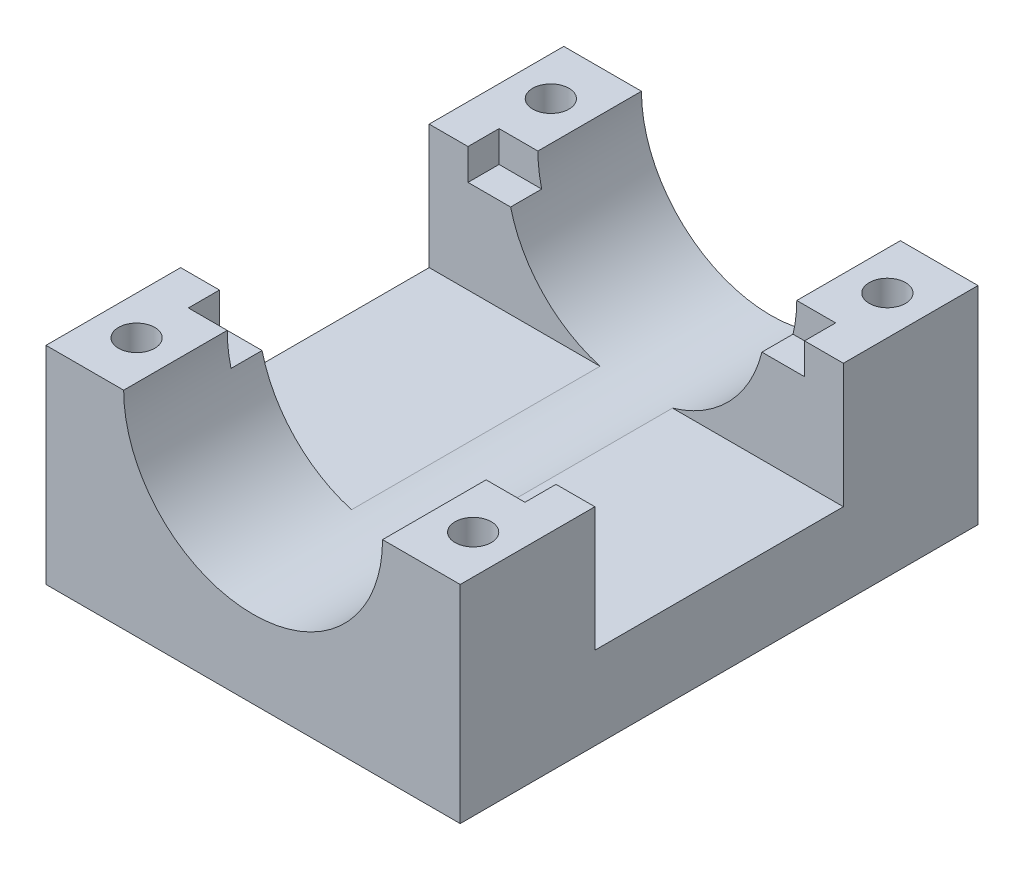
ISO-10303-21;
HEADER;
FILE_DESCRIPTION(('STEP AP214'),'2;1');
FILE_NAME('part.step','',(''),(''),'','','');
FILE_SCHEMA(('AUTOMOTIVE_DESIGN { 1 0 10303 214 1 1 1 1 }'));
ENDSEC;
DATA;
#1=APPLICATION_CONTEXT('core data for automotive mechanical design processes');
#2=APPLICATION_PROTOCOL_DEFINITION('international standard','automotive_design',2000,#1);
#3=PRODUCT_CONTEXT('',#1,'mechanical');
#4=PRODUCT('Part','Part','',(#3));
#5=PRODUCT_RELATED_PRODUCT_CATEGORY('part','',(#4));
#6=PRODUCT_DEFINITION_FORMATION('','',#4);
#7=PRODUCT_DEFINITION_CONTEXT('part definition',#1,'design');
#8=PRODUCT_DEFINITION('design','',#6,#7);
#9=PRODUCT_DEFINITION_SHAPE('','',#8);
#10=(LENGTH_UNIT() NAMED_UNIT(*) SI_UNIT(.MILLI.,.METRE.));
#11=(NAMED_UNIT(*) PLANE_ANGLE_UNIT() SI_UNIT($,.RADIAN.));
#12=(NAMED_UNIT(*) SI_UNIT($,.STERADIAN.) SOLID_ANGLE_UNIT());
#13=UNCERTAINTY_MEASURE_WITH_UNIT(LENGTH_MEASURE(1.E-05),#10,'distance_accuracy_value','');
#14=(GEOMETRIC_REPRESENTATION_CONTEXT(3) GLOBAL_UNCERTAINTY_ASSIGNED_CONTEXT((#13)) GLOBAL_UNIT_ASSIGNED_CONTEXT((#10,
#11,#12)) REPRESENTATION_CONTEXT('',''));
#15=CARTESIAN_POINT('',(0.,0.,0.));
#16=DIRECTION('',(0.,0.,1.));
#17=DIRECTION('',(1.,0.,0.));
#18=AXIS2_PLACEMENT_3D('',#15,#16,#17);
#19=CARTESIAN_POINT('',(0.,20.,0.));
#20=DIRECTION('',(0.,-1.,0.));
#21=DIRECTION('',(0.,0.,-1.));
#22=AXIS2_PLACEMENT_3D('',#19,#20,#21);
#23=PLANE('',#22);
#24=CARTESIAN_POINT('',(36.25,20.,-45.));
#25=DIRECTION('',(0.,1.,0.));
#26=DIRECTION('',(0.,0.,1.));
#27=AXIS2_PLACEMENT_3D('',#24,#25,#26);
#28=CIRCLE('',#27,1.75);
#29=CARTESIAN_POINT('',(36.25,20.,-43.25));
#30=VERTEX_POINT('',#29);
#31=EDGE_CURVE('E329',#30,#30,#28,.T.);
#32=ORIENTED_EDGE('',*,*,#31,.F.);
#33=EDGE_LOOP('',(#32));
#34=FACE_BOUND('',#33,.T.);
#35=DIRECTION('',(0.,0.,1.));
#36=VECTOR('',#35,1.);
#37=CARTESIAN_POINT('',(32.5,20.,-50.));
#38=LINE('',#37,#36);
#39=CARTESIAN_POINT('',(32.5,20.,-50.));
#40=VERTEX_POINT('',#39);
#41=CARTESIAN_POINT('',(32.5,20.,-40.));
#42=VERTEX_POINT('',#41);
#43=EDGE_CURVE('E396',#40,#42,#38,.T.);
#44=ORIENTED_EDGE('',*,*,#43,.T.);
#45=DIRECTION('',(-1.,0.,0.));
#46=VECTOR('',#45,1.);
#47=CARTESIAN_POINT('',(36.25,20.,-40.));
#48=LINE('',#47,#46);
#49=CARTESIAN_POINT('',(36.25,20.,-40.));
#50=VERTEX_POINT('',#49);
#51=EDGE_CURVE('E227',#50,#42,#48,.T.);
#52=ORIENTED_EDGE('',*,*,#51,.F.);
#53=DIRECTION('',(0.,0.,-1.));
#54=VECTOR('',#53,1.);
#55=CARTESIAN_POINT('',(36.25,20.,-37.));
#56=LINE('',#55,#54);
#57=CARTESIAN_POINT('',(36.25,20.,-37.));
#58=VERTEX_POINT('',#57);
#59=EDGE_CURVE('E254',#58,#50,#56,.T.);
#60=ORIENTED_EDGE('',*,*,#59,.F.);
#61=DIRECTION('',(1.,0.,0.));
#62=VECTOR('',#61,1.);
#63=CARTESIAN_POINT('',(0.,20.,-37.));
#64=LINE('',#63,#62);
#65=CARTESIAN_POINT('',(40.,20.,-37.));
#66=VERTEX_POINT('',#65);
#67=EDGE_CURVE('E232',#58,#66,#64,.T.);
#68=ORIENTED_EDGE('',*,*,#67,.T.);
#69=DIRECTION('',(0.,0.,-1.));
#70=VECTOR('',#69,1.);
#71=CARTESIAN_POINT('',(40.,20.,0.));
#72=LINE('',#71,#70);
#73=CARTESIAN_POINT('',(40.,20.,-50.));
#74=VERTEX_POINT('',#73);
#75=EDGE_CURVE('E363',#66,#74,#72,.T.);
#76=ORIENTED_EDGE('',*,*,#75,.T.);
#77=DIRECTION('',(-1.,0.,0.));
#78=VECTOR('',#77,1.);
#79=CARTESIAN_POINT('',(0.,20.,-50.));
#80=LINE('',#79,#78);
#81=EDGE_CURVE('E368',#74,#40,#80,.T.);
#82=ORIENTED_EDGE('',*,*,#81,.T.);
#83=EDGE_LOOP('',(#44,#52,#60,#68,#76,#82));
#84=FACE_BOUND('',#83,.T.);
#85=ADVANCED_FACE('F32',(#34,#84),#23,.F.);
#86=CARTESIAN_POINT('',(3.75,20.,-45.));
#87=DIRECTION('',(0.,1.,0.));
#88=DIRECTION('',(0.,0.,1.));
#89=AXIS2_PLACEMENT_3D('',#86,#87,#88);
#90=CIRCLE('',#89,1.75);
#91=CARTESIAN_POINT('',(3.75,20.,-43.25));
#92=VERTEX_POINT('',#91);
#93=EDGE_CURVE('E328',#92,#92,#90,.T.);
#94=ORIENTED_EDGE('',*,*,#93,.F.);
#95=EDGE_LOOP('',(#94));
#96=FACE_BOUND('',#95,.T.);
#97=CARTESIAN_POINT('',(0.,20.,-37.));
#98=VERTEX_POINT('',#97);
#99=CARTESIAN_POINT('',(3.75,20.,-37.));
#100=VERTEX_POINT('',#99);
#101=EDGE_CURVE('E310',#98,#100,#64,.T.);
#102=ORIENTED_EDGE('',*,*,#101,.T.);
#103=DIRECTION('',(0.,0.,1.));
#104=VECTOR('',#103,1.);
#105=CARTESIAN_POINT('',(3.75,20.,-37.));
#106=LINE('',#105,#104);
#107=CARTESIAN_POINT('',(3.75,20.,-40.));
#108=VERTEX_POINT('',#107);
#109=EDGE_CURVE('E273',#108,#100,#106,.T.);
#110=ORIENTED_EDGE('',*,*,#109,.F.);
#111=DIRECTION('',(-1.,0.,0.));
#112=VECTOR('',#111,1.);
#113=CARTESIAN_POINT('',(3.75,20.,-40.));
#114=LINE('',#113,#112);
#115=CARTESIAN_POINT('',(7.5,20.,-40.));
#116=VERTEX_POINT('',#115);
#117=EDGE_CURVE('E234',#116,#108,#114,.T.);
#118=ORIENTED_EDGE('',*,*,#117,.F.);
#119=DIRECTION('',(0.,0.,1.));
#120=VECTOR('',#119,1.);
#121=CARTESIAN_POINT('',(7.5,20.,-50.));
#122=LINE('',#121,#120);
#123=CARTESIAN_POINT('',(7.5,20.,-50.));
#124=VERTEX_POINT('',#123);
#125=EDGE_CURVE('E391',#116,#124,#122,.F.);
#126=ORIENTED_EDGE('',*,*,#125,.T.);
#127=CARTESIAN_POINT('',(0.,20.,-50.));
#128=VERTEX_POINT('',#127);
#129=EDGE_CURVE('E367',#124,#128,#80,.T.);
#130=ORIENTED_EDGE('',*,*,#129,.T.);
#131=DIRECTION('',(0.,0.,1.));
#132=VECTOR('',#131,1.);
#133=CARTESIAN_POINT('',(0.,20.,0.));
#134=LINE('',#133,#132);
#135=EDGE_CURVE('E355',#128,#98,#134,.T.);
#136=ORIENTED_EDGE('',*,*,#135,.T.);
#137=EDGE_LOOP('',(#102,#110,#118,#126,#130,#136));
#138=FACE_BOUND('',#137,.T.);
#139=ADVANCED_FACE('F453',(#96,#138),#23,.F.);
#140=CARTESIAN_POINT('',(36.2500000000004,20.,-5.));
#141=DIRECTION('',(0.,1.,0.));
#142=DIRECTION('',(0.,0.,1.));
#143=AXIS2_PLACEMENT_3D('',#140,#141,#142);
#144=CIRCLE('',#143,1.75);
#145=CARTESIAN_POINT('',(36.2500000000004,20.,-3.25));
#146=VERTEX_POINT('',#145);
#147=EDGE_CURVE('E335',#146,#146,#144,.T.);
#148=ORIENTED_EDGE('',*,*,#147,.F.);
#149=EDGE_LOOP('',(#148));
#150=FACE_BOUND('',#149,.T.);
#151=DIRECTION('',(1.,0.,0.));
#152=VECTOR('',#151,1.);
#153=CARTESIAN_POINT('',(0.,20.,-13.));
#154=LINE('',#153,#152);
#155=CARTESIAN_POINT('',(36.25,20.,-13.));
#156=VERTEX_POINT('',#155);
#157=CARTESIAN_POINT('',(40.,20.,-13.));
#158=VERTEX_POINT('',#157);
#159=EDGE_CURVE('E303',#156,#158,#154,.T.);
#160=ORIENTED_EDGE('',*,*,#159,.F.);
#161=DIRECTION('',(0.,0.,-1.));
#162=VECTOR('',#161,1.);
#163=CARTESIAN_POINT('',(36.25,20.,-13.));
#164=LINE('',#163,#162);
#165=CARTESIAN_POINT('',(36.25,20.,-10.));
#166=VERTEX_POINT('',#165);
#167=EDGE_CURVE('E242',#166,#156,#164,.T.);
#168=ORIENTED_EDGE('',*,*,#167,.F.);
#169=DIRECTION('',(1.,0.,0.));
#170=VECTOR('',#169,1.);
#171=CARTESIAN_POINT('',(36.25,20.,-10.));
#172=LINE('',#171,#170);
#173=CARTESIAN_POINT('',(32.5,20.,-10.));
#174=VERTEX_POINT('',#173);
#175=EDGE_CURVE('E247',#174,#166,#172,.T.);
#176=ORIENTED_EDGE('',*,*,#175,.F.);
#177=CARTESIAN_POINT('',(32.5,20.,0.));
#178=VERTEX_POINT('',#177);
#179=EDGE_CURVE('E395',#174,#178,#38,.T.);
#180=ORIENTED_EDGE('',*,*,#179,.T.);
#181=DIRECTION('',(1.,0.,0.));
#182=VECTOR('',#181,1.);
#183=CARTESIAN_POINT('',(0.,20.,0.));
#184=LINE('',#183,#182);
#185=CARTESIAN_POINT('',(40.,20.,0.));
#186=VERTEX_POINT('',#185);
#187=EDGE_CURVE('E358',#178,#186,#184,.T.);
#188=ORIENTED_EDGE('',*,*,#187,.T.);
#189=EDGE_CURVE('E364',#186,#158,#72,.T.);
#190=ORIENTED_EDGE('',*,*,#189,.T.);
#191=EDGE_LOOP('',(#160,#168,#176,#180,#188,#190));
#192=FACE_BOUND('',#191,.T.);
#193=ADVANCED_FACE('F430',(#150,#192),#23,.F.);
#194=CARTESIAN_POINT('',(0.,20.,0.));
#195=DIRECTION('',(1.,0.,0.));
#196=DIRECTION('',(0.,0.,-1.));
#197=AXIS2_PLACEMENT_3D('',#194,#195,#196);
#198=PLANE('',#197);
#199=DIRECTION('',(0.,0.,-1.));
#200=VECTOR('',#199,1.);
#201=CARTESIAN_POINT('',(0.,8.,-37.));
#202=LINE('',#201,#200);
#203=CARTESIAN_POINT('',(0.,8.,-13.));
#204=VERTEX_POINT('',#203);
#205=CARTESIAN_POINT('',(0.,8.,-37.));
#206=VERTEX_POINT('',#205);
#207=EDGE_CURVE('E296',#204,#206,#202,.T.);
#208=ORIENTED_EDGE('',*,*,#207,.T.);
#209=DIRECTION('',(0.,1.,0.));
#210=VECTOR('',#209,1.);
#211=CARTESIAN_POINT('',(0.,20.,-37.));
#212=LINE('',#211,#210);
#213=EDGE_CURVE('E300',#206,#98,#212,.T.);
#214=ORIENTED_EDGE('',*,*,#213,.T.);
#215=ORIENTED_EDGE('',*,*,#135,.F.);
#216=DIRECTION('',(0.,-1.,0.));
#217=VECTOR('',#216,1.);
#218=CARTESIAN_POINT('',(0.,20.,-50.));
#219=LINE('',#218,#217);
#220=CARTESIAN_POINT('',(0.,0.,-50.));
#221=VERTEX_POINT('',#220);
#222=EDGE_CURVE('E371',#128,#221,#219,.T.);
#223=ORIENTED_EDGE('',*,*,#222,.T.);
#224=DIRECTION('',(0.,0.,1.));
#225=VECTOR('',#224,1.);
#226=CARTESIAN_POINT('',(0.,0.,0.));
#227=LINE('',#226,#225);
#228=CARTESIAN_POINT('',(0.,0.,0.));
#229=VERTEX_POINT('',#228);
#230=EDGE_CURVE('E352',#221,#229,#227,.T.);
#231=ORIENTED_EDGE('',*,*,#230,.T.);
#232=DIRECTION('',(0.,-1.,0.));
#233=VECTOR('',#232,1.);
#234=CARTESIAN_POINT('',(0.,20.,0.));
#235=LINE('',#234,#233);
#236=CARTESIAN_POINT('',(0.,20.,0.));
#237=VERTEX_POINT('',#236);
#238=EDGE_CURVE('E388',#237,#229,#235,.T.);
#239=ORIENTED_EDGE('',*,*,#238,.F.);
#240=CARTESIAN_POINT('',(0.,20.,-13.));
#241=VERTEX_POINT('',#240);
#242=EDGE_CURVE('E359',#241,#237,#134,.T.);
#243=ORIENTED_EDGE('',*,*,#242,.F.);
#244=DIRECTION('',(0.,-1.,0.));
#245=VECTOR('',#244,1.);
#246=CARTESIAN_POINT('',(0.,8.,-13.));
#247=LINE('',#246,#245);
#248=EDGE_CURVE('E293',#241,#204,#247,.T.);
#249=ORIENTED_EDGE('',*,*,#248,.T.);
#250=EDGE_LOOP('',(#208,#214,#215,#223,#231,#239,#243,#249));
#251=FACE_BOUND('',#250,.T.);
#252=ADVANCED_FACE('F34',(#251),#198,.F.);
#253=CARTESIAN_POINT('',(0.,20.,0.));
#254=DIRECTION('',(0.,0.,-1.));
#255=DIRECTION('',(-1.,0.,0.));
#256=AXIS2_PLACEMENT_3D('',#253,#254,#255);
#257=PLANE('',#256);
#258=ORIENTED_EDGE('',*,*,#187,.F.);
#259=CARTESIAN_POINT('',(20.,20.,0.));
#260=DIRECTION('',(0.,0.,1.));
#261=DIRECTION('',(1.,0.,0.));
#262=AXIS2_PLACEMENT_3D('',#259,#260,#261);
#263=CIRCLE('',#262,12.5);
#264=CARTESIAN_POINT('',(7.5,20.,0.));
#265=VERTEX_POINT('',#264);
#266=EDGE_CURVE('E346',#265,#178,#263,.T.);
#267=ORIENTED_EDGE('',*,*,#266,.F.);
#268=EDGE_CURVE('E360',#237,#265,#184,.T.);
#269=ORIENTED_EDGE('',*,*,#268,.F.);
#270=ORIENTED_EDGE('',*,*,#238,.T.);
#271=DIRECTION('',(1.,0.,0.));
#272=VECTOR('',#271,1.);
#273=CARTESIAN_POINT('',(0.,0.,0.));
#274=LINE('',#273,#272);
#275=CARTESIAN_POINT('',(40.,0.,0.));
#276=VERTEX_POINT('',#275);
#277=EDGE_CURVE('E374',#229,#276,#274,.T.);
#278=ORIENTED_EDGE('',*,*,#277,.T.);
#279=DIRECTION('',(0.,-1.,0.));
#280=VECTOR('',#279,1.);
#281=CARTESIAN_POINT('',(40.,20.,0.));
#282=LINE('',#281,#280);
#283=EDGE_CURVE('E385',#186,#276,#282,.T.);
#284=ORIENTED_EDGE('',*,*,#283,.F.);
#285=EDGE_LOOP('',(#258,#267,#269,#270,#278,#284));
#286=FACE_BOUND('',#285,.T.);
#287=ADVANCED_FACE('F484',(#286),#257,.F.);
#288=CARTESIAN_POINT('',(40.,20.,0.));
#289=DIRECTION('',(-1.,0.,0.));
#290=DIRECTION('',(0.,0.,1.));
#291=AXIS2_PLACEMENT_3D('',#288,#289,#290);
#292=PLANE('',#291);
#293=ORIENTED_EDGE('',*,*,#75,.F.);
#294=DIRECTION('',(0.,1.,0.));
#295=VECTOR('',#294,1.);
#296=CARTESIAN_POINT('',(40.,20.,-37.));
#297=LINE('',#296,#295);
#298=CARTESIAN_POINT('',(40.,8.,-37.));
#299=VERTEX_POINT('',#298);
#300=EDGE_CURVE('E297',#299,#66,#297,.T.);
#301=ORIENTED_EDGE('',*,*,#300,.F.);
#302=DIRECTION('',(0.,0.,-1.));
#303=VECTOR('',#302,1.);
#304=CARTESIAN_POINT('',(40.,8.,-37.));
#305=LINE('',#304,#303);
#306=CARTESIAN_POINT('',(40.,8.,-13.));
#307=VERTEX_POINT('',#306);
#308=EDGE_CURVE('E306',#307,#299,#305,.T.);
#309=ORIENTED_EDGE('',*,*,#308,.F.);
#310=DIRECTION('',(0.,-1.,0.));
#311=VECTOR('',#310,1.);
#312=CARTESIAN_POINT('',(40.,8.,-13.));
#313=LINE('',#312,#311);
#314=EDGE_CURVE('E292',#158,#307,#313,.T.);
#315=ORIENTED_EDGE('',*,*,#314,.F.);
#316=ORIENTED_EDGE('',*,*,#189,.F.);
#317=ORIENTED_EDGE('',*,*,#283,.T.);
#318=DIRECTION('',(0.,0.,-1.));
#319=VECTOR('',#318,1.);
#320=CARTESIAN_POINT('',(40.,0.,0.));
#321=LINE('',#320,#319);
#322=CARTESIAN_POINT('',(40.,0.,-50.));
#323=VERTEX_POINT('',#322);
#324=EDGE_CURVE('E376',#276,#323,#321,.T.);
#325=ORIENTED_EDGE('',*,*,#324,.T.);
#326=DIRECTION('',(0.,-1.,0.));
#327=VECTOR('',#326,1.);
#328=CARTESIAN_POINT('',(40.,20.,-50.));
#329=LINE('',#328,#327);
#330=EDGE_CURVE('E382',#74,#323,#329,.T.);
#331=ORIENTED_EDGE('',*,*,#330,.F.);
#332=EDGE_LOOP('',(#293,#301,#309,#315,#316,#317,#325,#331));
#333=FACE_BOUND('',#332,.T.);
#334=ADVANCED_FACE('F474',(#333),#292,.F.);
#335=CARTESIAN_POINT('',(0.,20.,-50.));
#336=DIRECTION('',(0.,0.,1.));
#337=DIRECTION('',(1.,0.,0.));
#338=AXIS2_PLACEMENT_3D('',#335,#336,#337);
#339=PLANE('',#338);
#340=ORIENTED_EDGE('',*,*,#129,.F.);
#341=CARTESIAN_POINT('',(20.,20.,-50.));
#342=DIRECTION('',(0.,0.,1.));
#343=DIRECTION('',(1.,0.,0.));
#344=AXIS2_PLACEMENT_3D('',#341,#342,#343);
#345=CIRCLE('',#344,12.5);
#346=EDGE_CURVE('E349',#124,#40,#345,.T.);
#347=ORIENTED_EDGE('',*,*,#346,.T.);
#348=ORIENTED_EDGE('',*,*,#81,.F.);
#349=ORIENTED_EDGE('',*,*,#330,.T.);
#350=DIRECTION('',(-1.,0.,0.));
#351=VECTOR('',#350,1.);
#352=CARTESIAN_POINT('',(0.,0.,-50.));
#353=LINE('',#352,#351);
#354=EDGE_CURVE('E378',#323,#221,#353,.T.);
#355=ORIENTED_EDGE('',*,*,#354,.T.);
#356=ORIENTED_EDGE('',*,*,#222,.F.);
#357=EDGE_LOOP('',(#340,#347,#348,#349,#355,#356));
#358=FACE_BOUND('',#357,.T.);
#359=ADVANCED_FACE('F467',(#358),#339,.F.);
#360=CARTESIAN_POINT('',(3.75000000000042,20.,-5.));
#361=DIRECTION('',(0.,1.,0.));
#362=DIRECTION('',(0.,0.,1.));
#363=AXIS2_PLACEMENT_3D('',#360,#361,#362);
#364=CIRCLE('',#363,1.75);
#365=CARTESIAN_POINT('',(3.75000000000042,20.,-3.25));
#366=VERTEX_POINT('',#365);
#367=EDGE_CURVE('E313',#366,#366,#364,.T.);
#368=ORIENTED_EDGE('',*,*,#367,.F.);
#369=EDGE_LOOP('',(#368));
#370=FACE_BOUND('',#369,.T.);
#371=CARTESIAN_POINT('',(7.5,20.,-10.));
#372=VERTEX_POINT('',#371);
#373=EDGE_CURVE('E392',#265,#372,#122,.F.);
#374=ORIENTED_EDGE('',*,*,#373,.T.);
#375=DIRECTION('',(1.,0.,0.));
#376=VECTOR('',#375,1.);
#377=CARTESIAN_POINT('',(8.75,20.,-10.));
#378=LINE('',#377,#376);
#379=CARTESIAN_POINT('',(3.75,20.,-10.));
#380=VERTEX_POINT('',#379);
#381=EDGE_CURVE('E264',#380,#372,#378,.T.);
#382=ORIENTED_EDGE('',*,*,#381,.F.);
#383=DIRECTION('',(0.,0.,1.));
#384=VECTOR('',#383,1.);
#385=CARTESIAN_POINT('',(3.75,20.,-10.));
#386=LINE('',#385,#384);
#387=CARTESIAN_POINT('',(3.75,20.,-13.));
#388=VERTEX_POINT('',#387);
#389=EDGE_CURVE('E260',#388,#380,#386,.T.);
#390=ORIENTED_EDGE('',*,*,#389,.F.);
#391=EDGE_CURVE('E322',#241,#388,#154,.T.);
#392=ORIENTED_EDGE('',*,*,#391,.F.);
#393=ORIENTED_EDGE('',*,*,#242,.T.);
#394=ORIENTED_EDGE('',*,*,#268,.T.);
#395=EDGE_LOOP('',(#374,#382,#390,#392,#393,#394));
#396=FACE_BOUND('',#395,.T.);
#397=ADVANCED_FACE('F456',(#370,#396),#23,.F.);
#398=CARTESIAN_POINT('',(0.,0.,0.));
#399=DIRECTION('',(0.,-1.,0.));
#400=DIRECTION('',(0.,0.,-1.));
#401=AXIS2_PLACEMENT_3D('',#398,#399,#400);
#402=PLANE('',#401);
#403=CARTESIAN_POINT('',(3.75000000000042,0.,-5.));
#404=DIRECTION('',(0.,1.,0.));
#405=DIRECTION('',(0.,0.,1.));
#406=AXIS2_PLACEMENT_3D('',#403,#404,#405);
#407=CIRCLE('',#406,1.75);
#408=CARTESIAN_POINT('',(3.75000000000042,0.,-3.25));
#409=VERTEX_POINT('',#408);
#410=EDGE_CURVE('E338',#409,#409,#407,.T.);
#411=ORIENTED_EDGE('',*,*,#410,.T.);
#412=EDGE_LOOP('',(#411));
#413=FACE_BOUND('',#412,.T.);
#414=CARTESIAN_POINT('',(36.2500000000004,0.,-5.));
#415=DIRECTION('',(0.,1.,0.));
#416=DIRECTION('',(0.,0.,1.));
#417=AXIS2_PLACEMENT_3D('',#414,#415,#416);
#418=CIRCLE('',#417,1.75);
#419=CARTESIAN_POINT('',(36.2500000000004,0.,-3.25));
#420=VERTEX_POINT('',#419);
#421=EDGE_CURVE('E332',#420,#420,#418,.T.);
#422=ORIENTED_EDGE('',*,*,#421,.T.);
#423=EDGE_LOOP('',(#422));
#424=FACE_BOUND('',#423,.T.);
#425=CARTESIAN_POINT('',(36.25,0.,-45.));
#426=DIRECTION('',(0.,1.,0.));
#427=DIRECTION('',(0.,0.,1.));
#428=AXIS2_PLACEMENT_3D('',#425,#426,#427);
#429=CIRCLE('',#428,1.75);
#430=CARTESIAN_POINT('',(36.25,0.,-43.25));
#431=VERTEX_POINT('',#430);
#432=EDGE_CURVE('E325',#431,#431,#429,.T.);
#433=ORIENTED_EDGE('',*,*,#432,.T.);
#434=EDGE_LOOP('',(#433));
#435=FACE_BOUND('',#434,.T.);
#436=CARTESIAN_POINT('',(3.75,0.,-45.));
#437=DIRECTION('',(0.,1.,0.));
#438=DIRECTION('',(0.,0.,1.));
#439=AXIS2_PLACEMENT_3D('',#436,#437,#438);
#440=CIRCLE('',#439,1.75);
#441=CARTESIAN_POINT('',(3.75,0.,-43.25));
#442=VERTEX_POINT('',#441);
#443=EDGE_CURVE('E343',#442,#442,#440,.T.);
#444=ORIENTED_EDGE('',*,*,#443,.T.);
#445=EDGE_LOOP('',(#444));
#446=FACE_BOUND('',#445,.T.);
#447=ORIENTED_EDGE('',*,*,#230,.F.);
#448=ORIENTED_EDGE('',*,*,#354,.F.);
#449=ORIENTED_EDGE('',*,*,#324,.F.);
#450=ORIENTED_EDGE('',*,*,#277,.F.);
#451=EDGE_LOOP('',(#447,#448,#449,#450));
#452=FACE_BOUND('',#451,.T.);
#453=ADVANCED_FACE('F466',(#413,#424,#435,#446,#452),#402,.T.);
#454=CARTESIAN_POINT('',(20.,20.,-50.));
#455=DIRECTION('',(0.,0.,1.));
#456=DIRECTION('',(1.,0.,0.));
#457=AXIS2_PLACEMENT_3D('',#454,#455,#456);
#458=CYLINDRICAL_SURFACE('',#457,12.5);
#459=DIRECTION('',(0.,0.,1.));
#460=VECTOR('',#459,1.);
#461=CARTESIAN_POINT('',(7.8653389004884,17.,-50.));
#462=LINE('',#461,#460);
#463=CARTESIAN_POINT('',(7.8653389004884,17.,-13.));
#464=VERTEX_POINT('',#463);
#465=CARTESIAN_POINT('',(7.8653389004884,17.,-10.));
#466=VERTEX_POINT('',#465);
#467=EDGE_CURVE('E47',#464,#466,#462,.T.);
#468=ORIENTED_EDGE('',*,*,#467,.T.);
#469=CARTESIAN_POINT('',(20.,20.,-10.));
#470=DIRECTION('',(0.,0.,1.));
#471=DIRECTION('',(1.,0.,0.));
#472=AXIS2_PLACEMENT_3D('',#469,#470,#471);
#473=CIRCLE('',#472,12.5);
#474=EDGE_CURVE('E11',#466,#372,#473,.F.);
#475=ORIENTED_EDGE('',*,*,#474,.T.);
#476=ORIENTED_EDGE('',*,*,#373,.F.);
#477=ORIENTED_EDGE('',*,*,#266,.T.);
#478=ORIENTED_EDGE('',*,*,#179,.F.);
#479=CARTESIAN_POINT('',(20.,20.,-10.));
#480=DIRECTION('',(0.,0.,1.));
#481=DIRECTION('',(1.,0.,0.));
#482=AXIS2_PLACEMENT_3D('',#479,#480,#481);
#483=CIRCLE('',#482,12.5);
#484=CARTESIAN_POINT('',(32.1346610995116,17.,-10.));
#485=VERTEX_POINT('',#484);
#486=EDGE_CURVE('E40',#174,#485,#483,.F.);
#487=ORIENTED_EDGE('',*,*,#486,.T.);
#488=DIRECTION('',(0.,0.,1.));
#489=VECTOR('',#488,1.);
#490=CARTESIAN_POINT('',(32.1346610995116,17.,-50.));
#491=LINE('',#490,#489);
#492=CARTESIAN_POINT('',(32.1346610995116,17.,-13.));
#493=VERTEX_POINT('',#492);
#494=EDGE_CURVE('E282',#485,#493,#491,.F.);
#495=ORIENTED_EDGE('',*,*,#494,.T.);
#496=CARTESIAN_POINT('',(20.,20.,-13.));
#497=DIRECTION('',(0.,0.,1.));
#498=DIRECTION('',(1.,0.,0.));
#499=AXIS2_PLACEMENT_3D('',#496,#497,#498);
#500=CIRCLE('',#499,12.5);
#501=CARTESIAN_POINT('',(23.5,8.,-13.));
#502=VERTEX_POINT('',#501);
#503=EDGE_CURVE('E403',#493,#502,#500,.F.);
#504=ORIENTED_EDGE('',*,*,#503,.T.);
#505=DIRECTION('',(0.,0.,1.));
#506=VECTOR('',#505,1.);
#507=CARTESIAN_POINT('',(23.5,8.,-50.));
#508=LINE('',#507,#506);
#509=CARTESIAN_POINT('',(23.5,8.,-37.));
#510=VERTEX_POINT('',#509);
#511=EDGE_CURVE('E408',#502,#510,#508,.F.);
#512=ORIENTED_EDGE('',*,*,#511,.T.);
#513=CARTESIAN_POINT('',(20.,20.,-37.));
#514=DIRECTION('',(0.,0.,-1.));
#515=DIRECTION('',(-1.,0.,0.));
#516=AXIS2_PLACEMENT_3D('',#513,#514,#515);
#517=CIRCLE('',#516,12.5);
#518=CARTESIAN_POINT('',(32.1346610995116,17.,-37.));
#519=VERTEX_POINT('',#518);
#520=EDGE_CURVE('E217',#510,#519,#517,.F.);
#521=ORIENTED_EDGE('',*,*,#520,.T.);
#522=DIRECTION('',(0.,0.,1.));
#523=VECTOR('',#522,1.);
#524=CARTESIAN_POINT('',(32.1346610995116,17.,-50.));
#525=LINE('',#524,#523);
#526=CARTESIAN_POINT('',(32.1346610995116,17.,-40.));
#527=VERTEX_POINT('',#526);
#528=EDGE_CURVE('E212',#527,#519,#525,.T.);
#529=ORIENTED_EDGE('',*,*,#528,.F.);
#530=CARTESIAN_POINT('',(20.,20.,-40.));
#531=DIRECTION('',(0.,0.,-1.));
#532=DIRECTION('',(-1.,0.,0.));
#533=AXIS2_PLACEMENT_3D('',#530,#531,#532);
#534=CIRCLE('',#533,12.5);
#535=EDGE_CURVE('E415',#527,#42,#534,.F.);
#536=ORIENTED_EDGE('',*,*,#535,.T.);
#537=ORIENTED_EDGE('',*,*,#43,.F.);
#538=ORIENTED_EDGE('',*,*,#346,.F.);
#539=ORIENTED_EDGE('',*,*,#125,.F.);
#540=CARTESIAN_POINT('',(20.,20.,-40.));
#541=DIRECTION('',(0.,0.,-1.));
#542=DIRECTION('',(-1.,0.,0.));
#543=AXIS2_PLACEMENT_3D('',#540,#541,#542);
#544=CIRCLE('',#543,12.5);
#545=CARTESIAN_POINT('',(7.8653389004884,17.,-40.));
#546=VERTEX_POINT('',#545);
#547=EDGE_CURVE('E412',#116,#546,#544,.F.);
#548=ORIENTED_EDGE('',*,*,#547,.T.);
#549=DIRECTION('',(0.,0.,1.));
#550=VECTOR('',#549,1.);
#551=CARTESIAN_POINT('',(7.8653389004884,17.,-50.));
#552=LINE('',#551,#550);
#553=CARTESIAN_POINT('',(7.8653389004884,17.,-37.));
#554=VERTEX_POINT('',#553);
#555=EDGE_CURVE('E288',#546,#554,#552,.T.);
#556=ORIENTED_EDGE('',*,*,#555,.T.);
#557=CARTESIAN_POINT('',(16.5,8.,-37.));
#558=VERTEX_POINT('',#557);
#559=EDGE_CURVE('E406',#554,#558,#517,.F.);
#560=ORIENTED_EDGE('',*,*,#559,.T.);
#561=DIRECTION('',(0.,0.,1.));
#562=VECTOR('',#561,1.);
#563=CARTESIAN_POINT('',(16.5,8.,-50.));
#564=LINE('',#563,#562);
#565=CARTESIAN_POINT('',(16.5,8.,-13.));
#566=VERTEX_POINT('',#565);
#567=EDGE_CURVE('E402',#558,#566,#564,.T.);
#568=ORIENTED_EDGE('',*,*,#567,.T.);
#569=EDGE_CURVE('E399',#566,#464,#500,.F.);
#570=ORIENTED_EDGE('',*,*,#569,.T.);
#571=EDGE_LOOP('',(#468,#475,#476,#477,#478,#487,#495,#504,#512,#521,#529,#536,#537,#538,#539,
#548,#556,#560,#568,#570));
#572=FACE_BOUND('',#571,.T.);
#573=ADVANCED_FACE('F420',(#572),#458,.F.);
#574=CARTESIAN_POINT('',(3.75,0.,-45.));
#575=DIRECTION('',(0.,1.,0.));
#576=DIRECTION('',(0.,0.,1.));
#577=AXIS2_PLACEMENT_3D('',#574,#575,#576);
#578=CYLINDRICAL_SURFACE('',#577,1.75);
#579=ORIENTED_EDGE('',*,*,#443,.F.);
#580=EDGE_LOOP('',(#579));
#581=FACE_BOUND('',#580,.T.);
#582=ORIENTED_EDGE('',*,*,#93,.T.);
#583=EDGE_LOOP('',(#582));
#584=FACE_BOUND('',#583,.T.);
#585=ADVANCED_FACE('F501',(#581,#584),#578,.F.);
#586=CARTESIAN_POINT('',(36.25,0.,-45.));
#587=DIRECTION('',(0.,1.,0.));
#588=DIRECTION('',(0.,0.,1.));
#589=AXIS2_PLACEMENT_3D('',#586,#587,#588);
#590=CYLINDRICAL_SURFACE('',#589,1.75);
#591=ORIENTED_EDGE('',*,*,#432,.F.);
#592=EDGE_LOOP('',(#591));
#593=FACE_BOUND('',#592,.T.);
#594=ORIENTED_EDGE('',*,*,#31,.T.);
#595=EDGE_LOOP('',(#594));
#596=FACE_BOUND('',#595,.T.);
#597=ADVANCED_FACE('F491',(#593,#596),#590,.F.);
#598=CARTESIAN_POINT('',(36.2500000000004,0.,-5.));
#599=DIRECTION('',(0.,1.,0.));
#600=DIRECTION('',(0.,0.,1.));
#601=AXIS2_PLACEMENT_3D('',#598,#599,#600);
#602=CYLINDRICAL_SURFACE('',#601,1.75);
#603=ORIENTED_EDGE('',*,*,#421,.F.);
#604=EDGE_LOOP('',(#603));
#605=FACE_BOUND('',#604,.T.);
#606=ORIENTED_EDGE('',*,*,#147,.T.);
#607=EDGE_LOOP('',(#606));
#608=FACE_BOUND('',#607,.T.);
#609=ADVANCED_FACE('F488',(#605,#608),#602,.F.);
#610=CARTESIAN_POINT('',(3.75000000000042,0.,-5.));
#611=DIRECTION('',(0.,1.,0.));
#612=DIRECTION('',(0.,0.,1.));
#613=AXIS2_PLACEMENT_3D('',#610,#611,#612);
#614=CYLINDRICAL_SURFACE('',#613,1.75);
#615=ORIENTED_EDGE('',*,*,#410,.F.);
#616=EDGE_LOOP('',(#615));
#617=FACE_BOUND('',#616,.T.);
#618=ORIENTED_EDGE('',*,*,#367,.T.);
#619=EDGE_LOOP('',(#618));
#620=FACE_BOUND('',#619,.T.);
#621=ADVANCED_FACE('F490',(#617,#620),#614,.F.);
#622=CARTESIAN_POINT('',(0.,8.,-13.));
#623=DIRECTION('',(0.,0.,1.));
#624=DIRECTION('',(1.,0.,0.));
#625=AXIS2_PLACEMENT_3D('',#622,#623,#624);
#626=PLANE('',#625);
#627=ORIENTED_EDGE('',*,*,#391,.T.);
#628=DIRECTION('',(0.,1.,0.));
#629=VECTOR('',#628,1.);
#630=CARTESIAN_POINT('',(3.75,17.,-13.));
#631=LINE('',#630,#629);
#632=CARTESIAN_POINT('',(3.75,17.,-13.));
#633=VERTEX_POINT('',#632);
#634=EDGE_CURVE('E263',#633,#388,#631,.T.);
#635=ORIENTED_EDGE('',*,*,#634,.F.);
#636=DIRECTION('',(1.,0.,0.));
#637=VECTOR('',#636,1.);
#638=CARTESIAN_POINT('',(0.,17.,-13.));
#639=LINE('',#638,#637);
#640=EDGE_CURVE('E216',#633,#464,#639,.T.);
#641=ORIENTED_EDGE('',*,*,#640,.T.);
#642=ORIENTED_EDGE('',*,*,#569,.F.);
#643=DIRECTION('',(1.,0.,0.));
#644=VECTOR('',#643,1.);
#645=CARTESIAN_POINT('',(0.,8.,-13.));
#646=LINE('',#645,#644);
#647=EDGE_CURVE('E318',#204,#566,#646,.T.);
#648=ORIENTED_EDGE('',*,*,#647,.F.);
#649=ORIENTED_EDGE('',*,*,#248,.F.);
#650=EDGE_LOOP('',(#627,#635,#641,#642,#648,#649));
#651=FACE_BOUND('',#650,.T.);
#652=ADVANCED_FACE('F498',(#651),#626,.F.);
#653=CARTESIAN_POINT('',(0.,8.,-37.));
#654=DIRECTION('',(0.,-1.,0.));
#655=DIRECTION('',(0.,0.,-1.));
#656=AXIS2_PLACEMENT_3D('',#653,#654,#655);
#657=PLANE('',#656);
#658=DIRECTION('',(1.,0.,0.));
#659=VECTOR('',#658,1.);
#660=CARTESIAN_POINT('',(0.,8.,-37.));
#661=LINE('',#660,#659);
#662=EDGE_CURVE('E314',#206,#558,#661,.T.);
#663=ORIENTED_EDGE('',*,*,#662,.F.);
#664=ORIENTED_EDGE('',*,*,#207,.F.);
#665=ORIENTED_EDGE('',*,*,#647,.T.);
#666=ORIENTED_EDGE('',*,*,#567,.F.);
#667=EDGE_LOOP('',(#663,#664,#665,#666));
#668=FACE_BOUND('',#667,.T.);
#669=ADVANCED_FACE('F558',(#668),#657,.F.);
#670=CARTESIAN_POINT('',(0.,20.,-37.));
#671=DIRECTION('',(0.,0.,-1.));
#672=DIRECTION('',(-1.,0.,0.));
#673=AXIS2_PLACEMENT_3D('',#670,#671,#672);
#674=PLANE('',#673);
#675=DIRECTION('',(1.,0.,0.));
#676=VECTOR('',#675,1.);
#677=CARTESIAN_POINT('',(8.75,17.,-37.));
#678=LINE('',#677,#676);
#679=CARTESIAN_POINT('',(3.75,17.,-37.));
#680=VERTEX_POINT('',#679);
#681=EDGE_CURVE('E270',#680,#554,#678,.T.);
#682=ORIENTED_EDGE('',*,*,#681,.F.);
#683=DIRECTION('',(0.,1.,0.));
#684=VECTOR('',#683,1.);
#685=CARTESIAN_POINT('',(3.75,17.,-37.));
#686=LINE('',#685,#684);
#687=EDGE_CURVE('E279',#680,#100,#686,.T.);
#688=ORIENTED_EDGE('',*,*,#687,.T.);
#689=ORIENTED_EDGE('',*,*,#101,.F.);
#690=ORIENTED_EDGE('',*,*,#213,.F.);
#691=ORIENTED_EDGE('',*,*,#662,.T.);
#692=ORIENTED_EDGE('',*,*,#559,.F.);
#693=EDGE_LOOP('',(#682,#688,#689,#690,#691,#692));
#694=FACE_BOUND('',#693,.T.);
#695=ADVANCED_FACE('F563',(#694),#674,.F.);
#696=ORIENTED_EDGE('',*,*,#67,.F.);
#697=DIRECTION('',(0.,1.,0.));
#698=VECTOR('',#697,1.);
#699=CARTESIAN_POINT('',(36.25,17.,-37.));
#700=LINE('',#699,#698);
#701=CARTESIAN_POINT('',(36.25,17.,-37.));
#702=VERTEX_POINT('',#701);
#703=EDGE_CURVE('E222',#702,#58,#700,.T.);
#704=ORIENTED_EDGE('',*,*,#703,.F.);
#705=DIRECTION('',(1.,0.,0.));
#706=VECTOR('',#705,1.);
#707=CARTESIAN_POINT('',(0.,17.,-37.));
#708=LINE('',#707,#706);
#709=EDGE_CURVE('E206',#519,#702,#708,.T.);
#710=ORIENTED_EDGE('',*,*,#709,.F.);
#711=ORIENTED_EDGE('',*,*,#520,.F.);
#712=EDGE_CURVE('E317',#510,#299,#661,.T.);
#713=ORIENTED_EDGE('',*,*,#712,.T.);
#714=ORIENTED_EDGE('',*,*,#300,.T.);
#715=EDGE_LOOP('',(#696,#704,#710,#711,#713,#714));
#716=FACE_BOUND('',#715,.T.);
#717=ADVANCED_FACE('F230',(#716),#674,.F.);
#718=EDGE_CURVE('E321',#502,#307,#646,.T.);
#719=ORIENTED_EDGE('',*,*,#718,.T.);
#720=ORIENTED_EDGE('',*,*,#308,.T.);
#721=ORIENTED_EDGE('',*,*,#712,.F.);
#722=ORIENTED_EDGE('',*,*,#511,.F.);
#723=EDGE_LOOP('',(#719,#720,#721,#722));
#724=FACE_BOUND('',#723,.T.);
#725=ADVANCED_FACE('F566',(#724),#657,.F.);
#726=DIRECTION('',(-1.,0.,0.));
#727=VECTOR('',#726,1.);
#728=CARTESIAN_POINT('',(31.25,17.,-13.));
#729=LINE('',#728,#727);
#730=CARTESIAN_POINT('',(36.25,17.,-13.));
#731=VERTEX_POINT('',#730);
#732=EDGE_CURVE('E239',#731,#493,#729,.T.);
#733=ORIENTED_EDGE('',*,*,#732,.F.);
#734=DIRECTION('',(0.,1.,0.));
#735=VECTOR('',#734,1.);
#736=CARTESIAN_POINT('',(36.25,17.,-13.));
#737=LINE('',#736,#735);
#738=EDGE_CURVE('E251',#731,#156,#737,.T.);
#739=ORIENTED_EDGE('',*,*,#738,.T.);
#740=ORIENTED_EDGE('',*,*,#159,.T.);
#741=ORIENTED_EDGE('',*,*,#314,.T.);
#742=ORIENTED_EDGE('',*,*,#718,.F.);
#743=ORIENTED_EDGE('',*,*,#503,.F.);
#744=EDGE_LOOP('',(#733,#739,#740,#741,#742,#743));
#745=FACE_BOUND('',#744,.T.);
#746=ADVANCED_FACE('F437',(#745),#626,.F.);
#747=CARTESIAN_POINT('',(36.25,17.,-10.));
#748=DIRECTION('',(0.,0.,1.));
#749=DIRECTION('',(1.,0.,0.));
#750=AXIS2_PLACEMENT_3D('',#747,#748,#749);
#751=PLANE('',#750);
#752=ORIENTED_EDGE('',*,*,#175,.T.);
#753=DIRECTION('',(0.,1.,0.));
#754=VECTOR('',#753,1.);
#755=CARTESIAN_POINT('',(36.25,17.,-10.));
#756=LINE('',#755,#754);
#757=CARTESIAN_POINT('',(36.25,17.,-10.));
#758=VERTEX_POINT('',#757);
#759=EDGE_CURVE('E246',#758,#166,#756,.T.);
#760=ORIENTED_EDGE('',*,*,#759,.F.);
#761=DIRECTION('',(1.,0.,0.));
#762=VECTOR('',#761,1.);
#763=CARTESIAN_POINT('',(36.25,17.,-10.));
#764=LINE('',#763,#762);
#765=EDGE_CURVE('E241',#485,#758,#764,.T.);
#766=ORIENTED_EDGE('',*,*,#765,.F.);
#767=ORIENTED_EDGE('',*,*,#486,.F.);
#768=EDGE_LOOP('',(#752,#760,#766,#767));
#769=FACE_BOUND('',#768,.T.);
#770=ADVANCED_FACE('F425',(#769),#751,.F.);
#771=CARTESIAN_POINT('',(0.,17.,0.));
#772=DIRECTION('',(0.,-1.,0.));
#773=DIRECTION('',(0.,0.,-1.));
#774=AXIS2_PLACEMENT_3D('',#771,#772,#773);
#775=PLANE('',#774);
#776=ORIENTED_EDGE('',*,*,#765,.T.);
#777=DIRECTION('',(0.,0.,-1.));
#778=VECTOR('',#777,1.);
#779=CARTESIAN_POINT('',(36.25,17.,-13.));
#780=LINE('',#779,#778);
#781=EDGE_CURVE('E244',#758,#731,#780,.T.);
#782=ORIENTED_EDGE('',*,*,#781,.T.);
#783=ORIENTED_EDGE('',*,*,#732,.T.);
#784=ORIENTED_EDGE('',*,*,#494,.F.);
#785=EDGE_LOOP('',(#776,#782,#783,#784));
#786=FACE_BOUND('',#785,.T.);
#787=ADVANCED_FACE('F441',(#786),#775,.F.);
#788=CARTESIAN_POINT('',(36.25,17.,-13.));
#789=DIRECTION('',(1.,0.,0.));
#790=DIRECTION('',(0.,0.,-1.));
#791=AXIS2_PLACEMENT_3D('',#788,#789,#790);
#792=PLANE('',#791);
#793=ORIENTED_EDGE('',*,*,#167,.T.);
#794=ORIENTED_EDGE('',*,*,#738,.F.);
#795=ORIENTED_EDGE('',*,*,#781,.F.);
#796=ORIENTED_EDGE('',*,*,#759,.T.);
#797=EDGE_LOOP('',(#793,#794,#795,#796));
#798=FACE_BOUND('',#797,.T.);
#799=ADVANCED_FACE('F433',(#798),#792,.F.);
#800=CARTESIAN_POINT('',(36.25,17.,-40.));
#801=DIRECTION('',(0.,0.,-1.));
#802=DIRECTION('',(-1.,0.,0.));
#803=AXIS2_PLACEMENT_3D('',#800,#801,#802);
#804=PLANE('',#803);
#805=DIRECTION('',(-1.,0.,0.));
#806=VECTOR('',#805,1.);
#807=CARTESIAN_POINT('',(36.25,17.,-40.));
#808=LINE('',#807,#806);
#809=CARTESIAN_POINT('',(36.25,17.,-40.));
#810=VERTEX_POINT('',#809);
#811=EDGE_CURVE('E226',#810,#527,#808,.T.);
#812=ORIENTED_EDGE('',*,*,#811,.F.);
#813=DIRECTION('',(0.,1.,0.));
#814=VECTOR('',#813,1.);
#815=CARTESIAN_POINT('',(36.25,17.,-40.));
#816=LINE('',#815,#814);
#817=EDGE_CURVE('E224',#810,#50,#816,.T.);
#818=ORIENTED_EDGE('',*,*,#817,.T.);
#819=ORIENTED_EDGE('',*,*,#51,.T.);
#820=ORIENTED_EDGE('',*,*,#535,.F.);
#821=EDGE_LOOP('',(#812,#818,#819,#820));
#822=FACE_BOUND('',#821,.T.);
#823=ADVANCED_FACE('F448',(#822),#804,.F.);
#824=CARTESIAN_POINT('',(0.,17.,0.));
#825=DIRECTION('',(0.,1.,0.));
#826=DIRECTION('',(0.,0.,1.));
#827=AXIS2_PLACEMENT_3D('',#824,#825,#826);
#828=PLANE('',#827);
#829=ORIENTED_EDGE('',*,*,#528,.T.);
#830=ORIENTED_EDGE('',*,*,#709,.T.);
#831=DIRECTION('',(0.,0.,-1.));
#832=VECTOR('',#831,1.);
#833=CARTESIAN_POINT('',(36.25,17.,-37.));
#834=LINE('',#833,#832);
#835=EDGE_CURVE('E210',#702,#810,#834,.T.);
#836=ORIENTED_EDGE('',*,*,#835,.T.);
#837=ORIENTED_EDGE('',*,*,#811,.T.);
#838=EDGE_LOOP('',(#829,#830,#836,#837));
#839=FACE_BOUND('',#838,.T.);
#840=ADVANCED_FACE('F208',(#839),#828,.T.);
#841=CARTESIAN_POINT('',(36.25,17.,-37.));
#842=DIRECTION('',(1.,0.,0.));
#843=DIRECTION('',(0.,0.,-1.));
#844=AXIS2_PLACEMENT_3D('',#841,#842,#843);
#845=PLANE('',#844);
#846=ORIENTED_EDGE('',*,*,#59,.T.);
#847=ORIENTED_EDGE('',*,*,#817,.F.);
#848=ORIENTED_EDGE('',*,*,#835,.F.);
#849=ORIENTED_EDGE('',*,*,#703,.T.);
#850=EDGE_LOOP('',(#846,#847,#848,#849));
#851=FACE_BOUND('',#850,.T.);
#852=ADVANCED_FACE('F221',(#851),#845,.F.);
#853=CARTESIAN_POINT('',(3.75,17.,-40.));
#854=DIRECTION('',(0.,0.,-1.));
#855=DIRECTION('',(-1.,0.,0.));
#856=AXIS2_PLACEMENT_3D('',#853,#854,#855);
#857=PLANE('',#856);
#858=ORIENTED_EDGE('',*,*,#117,.T.);
#859=DIRECTION('',(0.,1.,0.));
#860=VECTOR('',#859,1.);
#861=CARTESIAN_POINT('',(3.75,17.,-40.));
#862=LINE('',#861,#860);
#863=CARTESIAN_POINT('',(3.75,17.,-40.));
#864=VERTEX_POINT('',#863);
#865=EDGE_CURVE('E276',#864,#108,#862,.T.);
#866=ORIENTED_EDGE('',*,*,#865,.F.);
#867=DIRECTION('',(-1.,0.,0.));
#868=VECTOR('',#867,1.);
#869=CARTESIAN_POINT('',(3.75,17.,-40.));
#870=LINE('',#869,#868);
#871=EDGE_CURVE('E272',#546,#864,#870,.T.);
#872=ORIENTED_EDGE('',*,*,#871,.F.);
#873=ORIENTED_EDGE('',*,*,#547,.F.);
#874=EDGE_LOOP('',(#858,#866,#872,#873));
#875=FACE_BOUND('',#874,.T.);
#876=ADVANCED_FACE('F643',(#875),#857,.F.);
#877=CARTESIAN_POINT('',(0.,17.,0.));
#878=DIRECTION('',(0.,-1.,0.));
#879=DIRECTION('',(0.,0.,-1.));
#880=AXIS2_PLACEMENT_3D('',#877,#878,#879);
#881=PLANE('',#880);
#882=ORIENTED_EDGE('',*,*,#871,.T.);
#883=DIRECTION('',(0.,0.,1.));
#884=VECTOR('',#883,1.);
#885=CARTESIAN_POINT('',(3.75,17.,-37.));
#886=LINE('',#885,#884);
#887=EDGE_CURVE('E55',#864,#680,#886,.T.);
#888=ORIENTED_EDGE('',*,*,#887,.T.);
#889=ORIENTED_EDGE('',*,*,#681,.T.);
#890=ORIENTED_EDGE('',*,*,#555,.F.);
#891=EDGE_LOOP('',(#882,#888,#889,#890));
#892=FACE_BOUND('',#891,.T.);
#893=ADVANCED_FACE('F645',(#892),#881,.F.);
#894=CARTESIAN_POINT('',(3.75,17.,-37.));
#895=DIRECTION('',(-1.,0.,0.));
#896=DIRECTION('',(0.,0.,1.));
#897=AXIS2_PLACEMENT_3D('',#894,#895,#896);
#898=PLANE('',#897);
#899=ORIENTED_EDGE('',*,*,#109,.T.);
#900=ORIENTED_EDGE('',*,*,#687,.F.);
#901=ORIENTED_EDGE('',*,*,#887,.F.);
#902=ORIENTED_EDGE('',*,*,#865,.T.);
#903=EDGE_LOOP('',(#899,#900,#901,#902));
#904=FACE_BOUND('',#903,.T.);
#905=ADVANCED_FACE('F664',(#904),#898,.F.);
#906=CARTESIAN_POINT('',(8.75,17.,-10.));
#907=DIRECTION('',(0.,0.,1.));
#908=DIRECTION('',(1.,0.,0.));
#909=AXIS2_PLACEMENT_3D('',#906,#907,#908);
#910=PLANE('',#909);
#911=DIRECTION('',(1.,0.,0.));
#912=VECTOR('',#911,1.);
#913=CARTESIAN_POINT('',(8.75,17.,-10.));
#914=LINE('',#913,#912);
#915=CARTESIAN_POINT('',(3.75,17.,-10.));
#916=VERTEX_POINT('',#915);
#917=EDGE_CURVE('E257',#916,#466,#914,.T.);
#918=ORIENTED_EDGE('',*,*,#917,.F.);
#919=DIRECTION('',(0.,1.,0.));
#920=VECTOR('',#919,1.);
#921=CARTESIAN_POINT('',(3.75,17.,-10.));
#922=LINE('',#921,#920);
#923=EDGE_CURVE('E249',#916,#380,#922,.T.);
#924=ORIENTED_EDGE('',*,*,#923,.T.);
#925=ORIENTED_EDGE('',*,*,#381,.T.);
#926=ORIENTED_EDGE('',*,*,#474,.F.);
#927=EDGE_LOOP('',(#918,#924,#925,#926));
#928=FACE_BOUND('',#927,.T.);
#929=ADVANCED_FACE('F666',(#928),#910,.F.);
#930=CARTESIAN_POINT('',(0.,17.,0.));
#931=DIRECTION('',(0.,-1.,0.));
#932=DIRECTION('',(0.,0.,-1.));
#933=AXIS2_PLACEMENT_3D('',#930,#931,#932);
#934=PLANE('',#933);
#935=ORIENTED_EDGE('',*,*,#640,.F.);
#936=DIRECTION('',(0.,0.,1.));
#937=VECTOR('',#936,1.);
#938=CARTESIAN_POINT('',(3.75,17.,-10.));
#939=LINE('',#938,#937);
#940=EDGE_CURVE('E259',#633,#916,#939,.T.);
#941=ORIENTED_EDGE('',*,*,#940,.T.);
#942=ORIENTED_EDGE('',*,*,#917,.T.);
#943=ORIENTED_EDGE('',*,*,#467,.F.);
#944=EDGE_LOOP('',(#935,#941,#942,#943));
#945=FACE_BOUND('',#944,.T.);
#946=ADVANCED_FACE('F672',(#945),#934,.F.);
#947=CARTESIAN_POINT('',(3.75,17.,-10.));
#948=DIRECTION('',(-1.,0.,0.));
#949=DIRECTION('',(0.,0.,1.));
#950=AXIS2_PLACEMENT_3D('',#947,#948,#949);
#951=PLANE('',#950);
#952=ORIENTED_EDGE('',*,*,#389,.T.);
#953=ORIENTED_EDGE('',*,*,#923,.F.);
#954=ORIENTED_EDGE('',*,*,#940,.F.);
#955=ORIENTED_EDGE('',*,*,#634,.T.);
#956=EDGE_LOOP('',(#952,#953,#954,#955));
#957=FACE_BOUND('',#956,.T.);
#958=ADVANCED_FACE('F763',(#957),#951,.F.);
#959=CLOSED_SHELL('',(#85,#139,#193,#252,#287,#334,#359,#397,#453,#573,#585,#597,#609,#621,#652,
#669,#695,#717,#725,#746,#770,#787,#799,#823,#840,#852,#876,#893,#905,#929,#946,#958));
#960=MANIFOLD_SOLID_BREP('B2',#959);
#961=ADVANCED_BREP_SHAPE_REPRESENTATION('',(#18,#960),#14);
#962=SHAPE_DEFINITION_REPRESENTATION(#9,#961);
ENDSEC;
END-ISO-10303-21;
